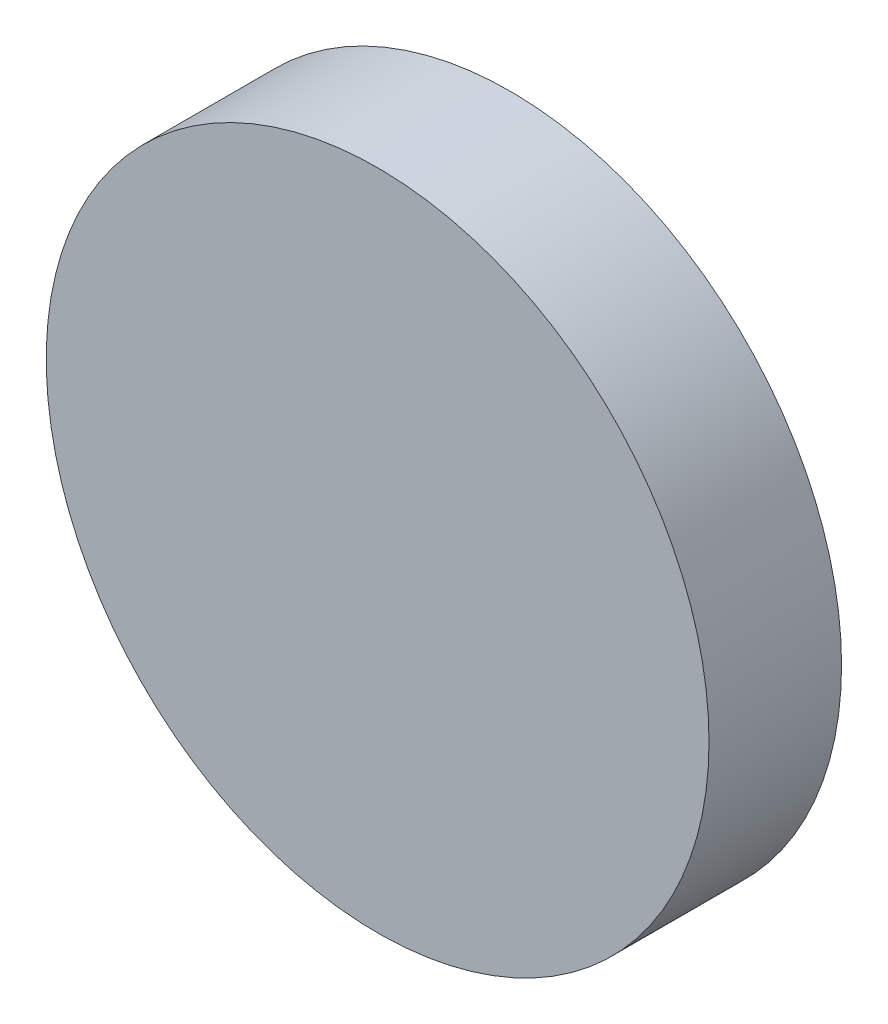
ISO-10303-21;
HEADER;
FILE_DESCRIPTION(('STEP AP214'),'2;1');
FILE_NAME('part.step','',(''),(''),'','','');
FILE_SCHEMA(('AUTOMOTIVE_DESIGN { 1 0 10303 214 1 1 1 1 }'));
ENDSEC;
DATA;
#1=APPLICATION_CONTEXT('core data for automotive mechanical design processes');
#2=APPLICATION_PROTOCOL_DEFINITION('international standard','automotive_design',2000,#1);
#3=PRODUCT_CONTEXT('',#1,'mechanical');
#4=PRODUCT('Part','Part','',(#3));
#5=PRODUCT_RELATED_PRODUCT_CATEGORY('part','',(#4));
#6=PRODUCT_DEFINITION_FORMATION('','',#4);
#7=PRODUCT_DEFINITION_CONTEXT('part definition',#1,'design');
#8=PRODUCT_DEFINITION('design','',#6,#7);
#9=PRODUCT_DEFINITION_SHAPE('','',#8);
#10=(LENGTH_UNIT() NAMED_UNIT(*) SI_UNIT(.MILLI.,.METRE.));
#11=(NAMED_UNIT(*) PLANE_ANGLE_UNIT() SI_UNIT($,.RADIAN.));
#12=(NAMED_UNIT(*) SI_UNIT($,.STERADIAN.) SOLID_ANGLE_UNIT());
#13=UNCERTAINTY_MEASURE_WITH_UNIT(LENGTH_MEASURE(1.E-05),#10,'distance_accuracy_value','');
#14=(GEOMETRIC_REPRESENTATION_CONTEXT(3) GLOBAL_UNCERTAINTY_ASSIGNED_CONTEXT((#13)) GLOBAL_UNIT_ASSIGNED_CONTEXT((#10,
#11,#12)) REPRESENTATION_CONTEXT('',''));
#15=CARTESIAN_POINT('',(0.,0.,0.));
#16=DIRECTION('',(0.,0.,1.));
#17=DIRECTION('',(1.,0.,0.));
#18=AXIS2_PLACEMENT_3D('',#15,#16,#17);
#19=CARTESIAN_POINT('',(0.,0.,5.));
#20=DIRECTION('',(0.,0.,-1.));
#21=DIRECTION('',(-1.,0.,0.));
#22=AXIS2_PLACEMENT_3D('',#19,#20,#21);
#23=CYLINDRICAL_SURFACE('',#22,12.5);
#24=CARTESIAN_POINT('',(0.,0.,5.));
#25=DIRECTION('',(0.,0.,1.));
#26=DIRECTION('',(1.,0.,0.));
#27=AXIS2_PLACEMENT_3D('',#24,#25,#26);
#28=CIRCLE('',#27,12.5);
#29=CARTESIAN_POINT('',(12.5,0.,5.));
#30=VERTEX_POINT('',#29);
#31=EDGE_CURVE('E10',#30,#30,#28,.T.);
#32=ORIENTED_EDGE('',*,*,#31,.F.);
#33=EDGE_LOOP('',(#32));
#34=FACE_BOUND('',#33,.T.);
#35=CARTESIAN_POINT('',(0.,0.,0.));
#36=DIRECTION('',(0.,0.,1.));
#37=DIRECTION('',(1.,0.,0.));
#38=AXIS2_PLACEMENT_3D('',#35,#36,#37);
#39=CIRCLE('',#38,12.5);
#40=CARTESIAN_POINT('',(12.5,0.,0.));
#41=VERTEX_POINT('',#40);
#42=EDGE_CURVE('E38',#41,#41,#39,.T.);
#43=ORIENTED_EDGE('',*,*,#42,.T.);
#44=EDGE_LOOP('',(#43));
#45=FACE_BOUND('',#44,.T.);
#46=ADVANCED_FACE('F35',(#34,#45),#23,.T.);
#47=CARTESIAN_POINT('',(0.,0.,5.));
#48=DIRECTION('',(0.,0.,1.));
#49=DIRECTION('',(1.,0.,0.));
#50=AXIS2_PLACEMENT_3D('',#47,#48,#49);
#51=PLANE('',#50);
#52=ORIENTED_EDGE('',*,*,#31,.T.);
#53=EDGE_LOOP('',(#52));
#54=FACE_BOUND('',#53,.T.);
#55=ADVANCED_FACE('F50',(#54),#51,.T.);
#56=CARTESIAN_POINT('',(0.,0.,0.));
#57=DIRECTION('',(0.,0.,1.));
#58=DIRECTION('',(1.,0.,0.));
#59=AXIS2_PLACEMENT_3D('',#56,#57,#58);
#60=PLANE('',#59);
#61=ORIENTED_EDGE('',*,*,#42,.F.);
#62=EDGE_LOOP('',(#61));
#63=FACE_BOUND('',#62,.T.);
#64=ADVANCED_FACE('F48',(#63),#60,.F.);
#65=CLOSED_SHELL('',(#46,#55,#64));
#66=MANIFOLD_SOLID_BREP('B2',#65);
#67=ADVANCED_BREP_SHAPE_REPRESENTATION('',(#18,#66),#14);
#68=SHAPE_DEFINITION_REPRESENTATION(#9,#67);
ENDSEC;
END-ISO-10303-21;
